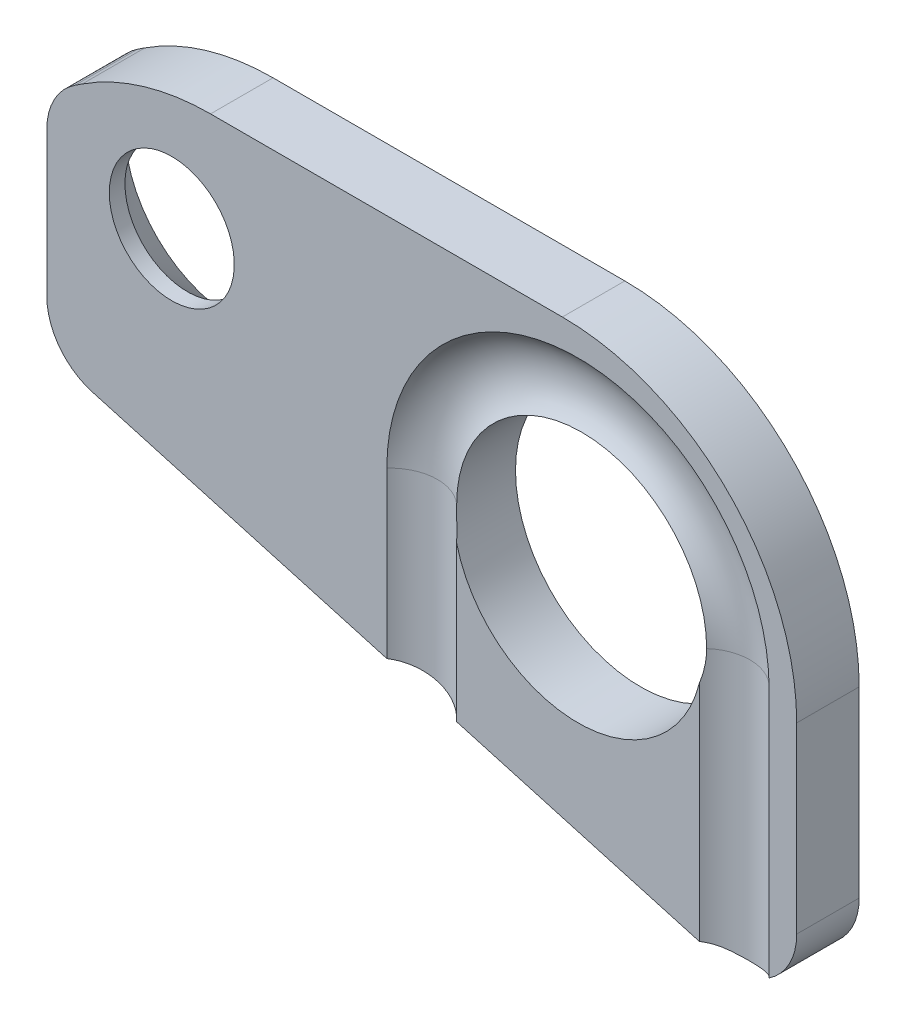
ISO-10303-21;
HEADER;
FILE_DESCRIPTION(('STEP AP214'),'2;1');
FILE_NAME('part.step','',(''),(''),'','','');
FILE_SCHEMA(('AUTOMOTIVE_DESIGN { 1 0 10303 214 1 1 1 1 }'));
ENDSEC;
DATA;
#1=APPLICATION_CONTEXT('core data for automotive mechanical design processes');
#2=APPLICATION_PROTOCOL_DEFINITION('international standard','automotive_design',2000,#1);
#3=PRODUCT_CONTEXT('',#1,'mechanical');
#4=PRODUCT('Part','Part','',(#3));
#5=PRODUCT_RELATED_PRODUCT_CATEGORY('part','',(#4));
#6=PRODUCT_DEFINITION_FORMATION('','',#4);
#7=PRODUCT_DEFINITION_CONTEXT('part definition',#1,'design');
#8=PRODUCT_DEFINITION('design','',#6,#7);
#9=PRODUCT_DEFINITION_SHAPE('','',#8);
#10=(LENGTH_UNIT() NAMED_UNIT(*) SI_UNIT(.MILLI.,.METRE.));
#11=(NAMED_UNIT(*) PLANE_ANGLE_UNIT() SI_UNIT($,.RADIAN.));
#12=(NAMED_UNIT(*) SI_UNIT($,.STERADIAN.) SOLID_ANGLE_UNIT());
#13=UNCERTAINTY_MEASURE_WITH_UNIT(LENGTH_MEASURE(1.E-05),#10,'distance_accuracy_value','');
#14=(GEOMETRIC_REPRESENTATION_CONTEXT(3) GLOBAL_UNCERTAINTY_ASSIGNED_CONTEXT((#13)) GLOBAL_UNIT_ASSIGNED_CONTEXT((#10,
#11,#12)) REPRESENTATION_CONTEXT('',''));
#15=CARTESIAN_POINT('',(0.,0.,0.));
#16=DIRECTION('',(0.,0.,1.));
#17=DIRECTION('',(1.,0.,0.));
#18=AXIS2_PLACEMENT_3D('',#15,#16,#17);
#19=CARTESIAN_POINT('',(-11.,8.95254635148678,2.));
#20=DIRECTION('',(0.,0.,-1.));
#21=DIRECTION('',(-1.,0.,0.));
#22=AXIS2_PLACEMENT_3D('',#19,#20,#21);
#23=PLANE('',#22);
#24=DIRECTION('',(0.,1.,0.));
#25=VECTOR('',#24,1.);
#26=CARTESIAN_POINT('',(7.88196601125011,-6.13485204243122,2.));
#27=LINE('',#26,#25);
#28=CARTESIAN_POINT('',(7.88196601125011,4.03545871653986,2.));
#29=VERTEX_POINT('',#28);
#30=CARTESIAN_POINT('',(7.8819660112501,-3.11474571347384,2.));
#31=VERTEX_POINT('',#30);
#32=EDGE_CURVE('E474',#29,#31,#27,.F.);
#33=ORIENTED_EDGE('',*,*,#32,.F.);
#34=CARTESIAN_POINT('',(4.,5.,2.));
#35=DIRECTION('',(0.,0.,1.));
#36=DIRECTION('',(-1.,0.,0.));
#37=AXIS2_PLACEMENT_3D('',#34,#35,#36);
#38=CIRCLE('',#37,4.);
#39=CARTESIAN_POINT('',(0.118033988749895,4.03545871653985,2.));
#40=VERTEX_POINT('',#39);
#41=EDGE_CURVE('E170',#40,#29,#38,.T.);
#42=ORIENTED_EDGE('',*,*,#41,.F.);
#43=DIRECTION('',(0.,-1.,0.));
#44=VECTOR('',#43,1.);
#45=CARTESIAN_POINT('',(0.118033988749895,5.,2.));
#46=LINE('',#45,#44);
#47=CARTESIAN_POINT('',(0.118033988749895,-0.910454763466702,2.));
#48=VERTEX_POINT('',#47);
#49=EDGE_CURVE('E62',#48,#40,#46,.F.);
#50=ORIENTED_EDGE('',*,*,#49,.F.);
#51=DIRECTION('',(0.961980017834063,-0.273119836862826,0.));
#52=VECTOR('',#51,1.);
#53=CARTESIAN_POINT('',(-11.5462396737256,2.40119876442207,2.));
#54=LINE('',#53,#52);
#55=EDGE_CURVE('E425',#48,#31,#54,.T.);
#56=ORIENTED_EDGE('',*,*,#55,.T.);
#57=EDGE_LOOP('',(#33,#42,#50,#56));
#58=FACE_BOUND('',#57,.T.);
#59=ADVANCED_FACE('F47',(#58),#23,.F.);
#60=CARTESIAN_POINT('',(-9.,8.2,2.));
#61=DIRECTION('',(0.,0.,1.));
#62=DIRECTION('',(-1.,0.,0.));
#63=AXIS2_PLACEMENT_3D('',#60,#61,#62);
#64=CIRCLE('',#63,2.);
#65=CARTESIAN_POINT('',(-11.,8.2,2.));
#66=VERTEX_POINT('',#65);
#67=EDGE_CURVE('E446',#66,#66,#64,.T.);
#68=ORIENTED_EDGE('',*,*,#67,.F.);
#69=EDGE_LOOP('',(#68));
#70=FACE_BOUND('',#69,.T.);
#71=DIRECTION('',(0.,1.,0.));
#72=VECTOR('',#71,1.);
#73=CARTESIAN_POINT('',(10.1180339887499,-6.13485204243122,2.));
#74=LINE('',#73,#72);
#75=CARTESIAN_POINT('',(10.1180339887499,-3.01143862802959,2.));
#76=VERTEX_POINT('',#75);
#77=CARTESIAN_POINT('',(10.1180339887499,5.,2.));
#78=VERTEX_POINT('',#77);
#79=EDGE_CURVE('E278',#76,#78,#74,.T.);
#80=ORIENTED_EDGE('',*,*,#79,.F.);
#81=CARTESIAN_POINT('',(9.,-1.35312623285189,2.));
#82=DIRECTION('',(0.,0.,1.));
#83=DIRECTION('',(-1.,0.,0.));
#84=AXIS2_PLACEMENT_3D('',#81,#82,#83);
#85=CIRCLE('',#84,2.);
#86=CARTESIAN_POINT('',(11.,-1.35312623285187,2.));
#87=VERTEX_POINT('',#86);
#88=EDGE_CURVE('E433',#76,#87,#85,.T.);
#89=ORIENTED_EDGE('',*,*,#88,.T.);
#90=DIRECTION('',(0.,1.,0.));
#91=VECTOR('',#90,1.);
#92=CARTESIAN_POINT('',(11.,-1.35312623285187,2.));
#93=LINE('',#92,#91);
#94=CARTESIAN_POINT('',(11.,4.49999999999995,2.));
#95=VERTEX_POINT('',#94);
#96=EDGE_CURVE('E435',#87,#95,#93,.T.);
#97=ORIENTED_EDGE('',*,*,#96,.T.);
#98=CARTESIAN_POINT('',(3.5,4.5,2.));
#99=DIRECTION('',(0.,0.,1.));
#100=DIRECTION('',(1.,0.,0.));
#101=AXIS2_PLACEMENT_3D('',#98,#99,#100);
#102=CIRCLE('',#101,7.5);
#103=CARTESIAN_POINT('',(3.49999999999995,12.,2.));
#104=VERTEX_POINT('',#103);
#105=EDGE_CURVE('E145',#95,#104,#102,.T.);
#106=ORIENTED_EDGE('',*,*,#105,.T.);
#107=DIRECTION('',(-1.,0.,0.));
#108=VECTOR('',#107,1.);
#109=CARTESIAN_POINT('',(3.49999999999995,12.,2.));
#110=LINE('',#109,#108);
#111=CARTESIAN_POINT('',(-7.7595138177386,12.,2.));
#112=VERTEX_POINT('',#111);
#113=EDGE_CURVE('E137',#104,#112,#110,.T.);
#114=ORIENTED_EDGE('',*,*,#113,.T.);
#115=CARTESIAN_POINT('',(-7.75951381773863,4.5,2.));
#116=DIRECTION('',(0.,0.,1.));
#117=DIRECTION('',(1.,0.,0.));
#118=AXIS2_PLACEMENT_3D('',#115,#116,#117);
#119=CIRCLE('',#118,7.5);
#120=CARTESIAN_POINT('',(-11.8638840401089,10.7772721048016,2.));
#121=VERTEX_POINT('',#120);
#122=EDGE_CURVE('E142',#112,#121,#119,.T.);
#123=ORIENTED_EDGE('',*,*,#122,.T.);
#124=DIRECTION('',(-0.836969613973545,-0.547249362982704,0.));
#125=VECTOR('',#124,1.);
#126=CARTESIAN_POINT('',(-11.8638840401089,10.7772721048016,2.));
#127=LINE('',#126,#125);
#128=CARTESIAN_POINT('',(-12.0944987259654,10.6264855794339,2.));
#129=VERTEX_POINT('',#128);
#130=EDGE_CURVE('E71',#121,#129,#127,.T.);
#131=ORIENTED_EDGE('',*,*,#130,.T.);
#132=CARTESIAN_POINT('',(-11.,8.95254635148678,2.));
#133=DIRECTION('',(0.,0.,1.));
#134=DIRECTION('',(-1.,0.,0.));
#135=AXIS2_PLACEMENT_3D('',#132,#133,#134);
#136=CIRCLE('',#135,2.);
#137=CARTESIAN_POINT('',(-13.,8.95254635148678,2.));
#138=VERTEX_POINT('',#137);
#139=EDGE_CURVE('E187',#129,#138,#136,.T.);
#140=ORIENTED_EDGE('',*,*,#139,.T.);
#141=DIRECTION('',(0.,-1.,0.));
#142=VECTOR('',#141,1.);
#143=CARTESIAN_POINT('',(-13.,8.95254635148678,2.));
#144=LINE('',#143,#142);
#145=CARTESIAN_POINT('',(-13.,4.32515880009021,2.));
#146=VERTEX_POINT('',#145);
#147=EDGE_CURVE('E119',#138,#146,#144,.T.);
#148=ORIENTED_EDGE('',*,*,#147,.T.);
#149=CARTESIAN_POINT('',(-11.,4.3251588000902,2.));
#150=DIRECTION('',(0.,0.,1.));
#151=DIRECTION('',(-1.,0.,0.));
#152=AXIS2_PLACEMENT_3D('',#149,#150,#151);
#153=CIRCLE('',#152,2.);
#154=CARTESIAN_POINT('',(-11.5462396737256,2.40119876442207,2.));
#155=VERTEX_POINT('',#154);
#156=EDGE_CURVE('E422',#146,#155,#153,.T.);
#157=ORIENTED_EDGE('',*,*,#156,.T.);
#158=CARTESIAN_POINT('',(-2.1180339887499,-0.275603197002795,2.));
#159=VERTEX_POINT('',#158);
#160=EDGE_CURVE('E428',#155,#159,#54,.T.);
#161=ORIENTED_EDGE('',*,*,#160,.T.);
#162=DIRECTION('',(0.,-1.,0.));
#163=VECTOR('',#162,1.);
#164=CARTESIAN_POINT('',(-2.11803398874989,5.,2.));
#165=LINE('',#164,#163);
#166=CARTESIAN_POINT('',(-2.1180339887499,5.,2.));
#167=VERTEX_POINT('',#166);
#168=EDGE_CURVE('E473',#167,#159,#165,.T.);
#169=ORIENTED_EDGE('',*,*,#168,.F.);
#170=CARTESIAN_POINT('',(4.,5.,2.));
#171=DIRECTION('',(0.,0.,-1.));
#172=DIRECTION('',(-1.,0.,0.));
#173=AXIS2_PLACEMENT_3D('',#170,#171,#172);
#174=CIRCLE('',#173,6.1180339887499);
#175=EDGE_CURVE('E466',#78,#167,#174,.F.);
#176=ORIENTED_EDGE('',*,*,#175,.F.);
#177=EDGE_LOOP('',(#80,#89,#97,#106,#114,#123,#131,#140,#148,#157,#161,#169,#176));
#178=FACE_BOUND('',#177,.T.);
#179=ADVANCED_FACE('F140',(#70,#178),#23,.F.);
#180=CARTESIAN_POINT('',(9.,-1.35312623285189,2.));
#181=DIRECTION('',(0.,0.,-1.));
#182=DIRECTION('',(-1.,0.,0.));
#183=AXIS2_PLACEMENT_3D('',#180,#181,#182);
#184=CYLINDRICAL_SURFACE('',#183,2.);
#185=CARTESIAN_POINT('',(8.45376032627433,-3.27708626852001,1.60299526885265));
#186=CARTESIAN_POINT('',(8.48522309326046,-3.28602006949857,1.59069325521865));
#187=CARTESIAN_POINT('',(8.51725960609973,-3.2942795137939,1.57939323557169));
#188=CARTESIAN_POINT('',(8.58235776485366,-3.30931962921398,1.55890951912295));
#189=CARTESIAN_POINT('',(8.61541992548174,-3.31609954367409,1.54972690507435));
#190=CARTESIAN_POINT('',(8.71585240717368,-3.33400133266125,1.52555557945458));
#191=CARTESIAN_POINT('',(8.78452521029864,-3.3427016258485,1.51392107633393));
#192=CARTESIAN_POINT('',(8.9235609202137,-3.35288491522806,1.5003149736965));
#193=CARTESIAN_POINT('',(8.9939285368118,-3.35434469972258,1.49837445110057));
#194=CARTESIAN_POINT('',(9.13392647575033,-3.34986388215696,1.50435126938794));
#195=CARTESIAN_POINT('',(9.20355754021604,-3.34393162577304,1.51225749320674));
#196=CARTESIAN_POINT('',(9.33796605577399,-3.32549588062348,1.53702114705661));
#197=CARTESIAN_POINT('',(9.40282725678758,-3.31320457616076,1.55358971584447));
#198=CARTESIAN_POINT('',(9.52865205174057,-3.28307954873457,1.59468338474754));
#199=CARTESIAN_POINT('',(9.58961171879572,-3.26524034440537,1.61921635480605));
#200=CARTESIAN_POINT('',(9.71212669864348,-3.22327484927443,1.67791203905542));
#201=CARTESIAN_POINT('',(9.77320025062785,-3.19871543955886,1.7127627653736));
#202=CARTESIAN_POINT('',(9.88880103590782,-3.14590915172949,1.78968809108542));
#203=CARTESIAN_POINT('',(9.94332951007539,-3.11766297471106,1.83176131748812));
#204=CARTESIAN_POINT('',(10.0163010847421,-3.07584821906348,1.89637495302139));
#205=CARTESIAN_POINT('',(10.0375660019688,-3.06311110615844,1.91634619863391));
#206=CARTESIAN_POINT('',(10.0787750888001,-3.0374160086054,1.95736586225701));
#207=CARTESIAN_POINT('',(10.0987221447296,-3.02445859046944,1.97841173427126));
#208=CARTESIAN_POINT('',(10.1180339887499,-3.01143862802959,2.));
#209=B_SPLINE_CURVE_WITH_KNOTS('',3,(#185,#186,#187,#188,#189,#190,#191,#192,#193,#194,#195,
#196,#197,#198,#199,#200,#201,#202,#203,#204,#205,#206,#207,#208),.UNSPECIFIED.,.F.,.F.,(4,2,2,
2,2,2,2,2,2,2,2,4),(0.,0.104783478615842,0.209620420905259,0.419107847065285,0.629266418065994,
0.839187933108115,1.04251795373459,1.24604950757646,1.46869638272158,1.69130097966603,
1.78676084731813,1.88200419230909),.UNSPECIFIED.);
#210=CARTESIAN_POINT('',(8.45376032627433,-3.27708626852001,1.60299526885265));
#211=VERTEX_POINT('',#210);
#212=EDGE_CURVE('E271',#211,#76,#209,.T.);
#213=ORIENTED_EDGE('',*,*,#212,.F.);
#214=DIRECTION('',(0.,0.,-1.));
#215=VECTOR('',#214,1.);
#216=CARTESIAN_POINT('',(8.45376032627433,-3.27708626852001,2.));
#217=LINE('',#216,#215);
#218=CARTESIAN_POINT('',(8.45376032627433,-3.27708626852001,0.));
#219=VERTEX_POINT('',#218);
#220=EDGE_CURVE('E197',#211,#219,#217,.T.);
#221=ORIENTED_EDGE('',*,*,#220,.T.);
#222=CARTESIAN_POINT('',(9.,-1.35312623285189,0.));
#223=DIRECTION('',(0.,0.,1.));
#224=DIRECTION('',(-1.,0.,0.));
#225=AXIS2_PLACEMENT_3D('',#222,#223,#224);
#226=CIRCLE('',#225,2.);
#227=CARTESIAN_POINT('',(11.,-1.35312623285187,0.));
#228=VERTEX_POINT('',#227);
#229=EDGE_CURVE('E177',#219,#228,#226,.T.);
#230=ORIENTED_EDGE('',*,*,#229,.T.);
#231=DIRECTION('',(0.,0.,-1.));
#232=VECTOR('',#231,1.);
#233=CARTESIAN_POINT('',(11.,-1.35312623285187,2.));
#234=LINE('',#233,#232);
#235=EDGE_CURVE('E194',#87,#228,#234,.T.);
#236=ORIENTED_EDGE('',*,*,#235,.F.);
#237=ORIENTED_EDGE('',*,*,#88,.F.);
#238=EDGE_LOOP('',(#213,#221,#230,#236,#237));
#239=FACE_BOUND('',#238,.T.);
#240=ADVANCED_FACE('F243',(#239),#184,.T.);
#241=CARTESIAN_POINT('',(4.,5.,2.));
#242=DIRECTION('',(0.,0.,-1.));
#243=DIRECTION('',(-1.,0.,0.));
#244=AXIS2_PLACEMENT_3D('',#241,#242,#243);
#245=CYLINDRICAL_SURFACE('',#244,4.);
#246=CARTESIAN_POINT('',(4.,5.,0.));
#247=DIRECTION('',(0.,0.,1.));
#248=DIRECTION('',(-1.,0.,0.));
#249=AXIS2_PLACEMENT_3D('',#246,#247,#248);
#250=CIRCLE('',#249,4.);
#251=CARTESIAN_POINT('',(0.,5.,0.));
#252=VERTEX_POINT('',#251);
#253=EDGE_CURVE('E443',#252,#252,#250,.T.);
#254=ORIENTED_EDGE('',*,*,#253,.F.);
#255=EDGE_LOOP('',(#254));
#256=FACE_BOUND('',#255,.T.);
#257=ORIENTED_EDGE('',*,*,#41,.T.);
#258=CARTESIAN_POINT('',(7.88196601125011,4.03545871653986,2.));
#259=CARTESIAN_POINT('',(7.89683000367049,4.09523481356459,1.98342398659821));
#260=CARTESIAN_POINT('',(7.91041946468569,4.15587272009715,1.96893202296529));
#261=CARTESIAN_POINT('',(7.93487403053109,4.27844212948327,1.94366771261361));
#262=CARTESIAN_POINT('',(7.94574001335882,4.34037320844973,1.93289416672439));
#263=CARTESIAN_POINT('',(7.96447483003007,4.46442745556306,1.9147122418162));
#264=CARTESIAN_POINT('',(7.97237639479184,4.52654039958246,1.90726692775157));
#265=CARTESIAN_POINT('',(7.98526847636052,4.65133545782075,1.89528329379255));
#266=CARTESIAN_POINT('',(7.99025956179831,4.71401745842902,1.89074440604211));
#267=CARTESIAN_POINT('',(7.99584125474153,4.81390416625009,1.88569652582128));
#268=CARTESIAN_POINT('',(7.99739708494606,4.85101533962385,1.88429823508406));
#269=CARTESIAN_POINT('',(7.99947839282466,4.92541674747981,1.88243238101856));
#270=CARTESIAN_POINT('',(8.0000003385797,4.9627071610048,1.88196800802427));
#271=CARTESIAN_POINT('',(8.,5.,1.88196601125011));
#272=B_SPLINE_CURVE_WITH_KNOTS('',3,(#258,#259,#260,#261,#262,#263,#264,#265,#266,#267,#268,
#269,#270,#271),.UNSPECIFIED.,.F.,.F.,(4,2,2,2,2,2,4),(0.,0.191266772856852,0.382471805408383,
0.571498799983244,0.760488851286407,0.871975634702898,0.983842622917628),.UNSPECIFIED.);
#273=CARTESIAN_POINT('',(8.,5.,1.88196601125011));
#274=VERTEX_POINT('',#273);
#275=EDGE_CURVE('E284',#29,#274,#272,.T.);
#276=ORIENTED_EDGE('',*,*,#275,.T.);
#277=CARTESIAN_POINT('',(4.,5.,1.88196601125011));
#278=DIRECTION('',(0.,0.,1.));
#279=DIRECTION('',(1.,0.,0.));
#280=AXIS2_PLACEMENT_3D('',#277,#278,#279);
#281=CIRCLE('',#280,4.);
#282=CARTESIAN_POINT('',(0.,5.,1.88196601125011));
#283=VERTEX_POINT('',#282);
#284=EDGE_CURVE('E214',#274,#283,#281,.T.);
#285=ORIENTED_EDGE('',*,*,#284,.T.);
#286=CARTESIAN_POINT('',(0.,5.,1.88196601125011));
#287=CARTESIAN_POINT('',(-4.38086623795825E-07,4.95884462813062,1.88196874844918));
#288=CARTESIAN_POINT('',(0.000635286188607783,4.91769338522283,1.88253383323086));
#289=CARTESIAN_POINT('',(0.00317392897887362,4.83546064551654,1.88481110389118));
#290=CARTESIAN_POINT('',(0.00507688552456335,4.79437915084834,1.88652332419628));
#291=CARTESIAN_POINT('',(0.0126385224392315,4.6719879675915,1.89337769394507));
#292=CARTESIAN_POINT('',(0.0201502868573378,4.59087460820093,1.90023703121141));
#293=CARTESIAN_POINT('',(0.0400184087380348,4.42979967667277,1.91900508531431));
#294=CARTESIAN_POINT('',(0.0523757887870486,4.34983835134789,1.93091486800645));
#295=CARTESIAN_POINT('',(0.0743957490193251,4.23105761515482,1.95320389751663));
#296=CARTESIAN_POINT('',(0.0823547316062631,4.19150399978317,1.9614121799934));
#297=CARTESIAN_POINT('',(0.0993789151244316,4.11299865988592,1.97945249325174));
#298=CARTESIAN_POINT('',(0.108444426604257,4.07404710780162,1.98928498014297));
#299=CARTESIAN_POINT('',(0.118033988749895,4.03545871653985,2.));
#300=B_SPLINE_CURVE_WITH_KNOTS('',3,(#286,#287,#288,#289,#290,#291,#292,#293,#294,#295,#296,
#297,#298,#299),.UNSPECIFIED.,.F.,.F.,(4,2,2,2,2,2,4),(0.,0.123448856740869,0.246901418447781,
0.491841840838475,0.736833981666203,0.86030732785158,0.983815406995786),.UNSPECIFIED.);
#301=EDGE_CURVE('E207',#283,#40,#300,.T.);
#302=ORIENTED_EDGE('',*,*,#301,.T.);
#303=EDGE_LOOP('',(#257,#276,#285,#302));
#304=FACE_BOUND('',#303,.T.);
#305=ADVANCED_FACE('F216',(#256,#304),#245,.F.);
#306=CARTESIAN_POINT('',(-11.,8.95254635148678,0.));
#307=DIRECTION('',(0.,0.,-1.));
#308=DIRECTION('',(-1.,0.,0.));
#309=AXIS2_PLACEMENT_3D('',#306,#307,#308);
#310=PLANE('',#309);
#311=CARTESIAN_POINT('',(-9.,8.2,0.));
#312=DIRECTION('',(0.,0.,-1.));
#313=DIRECTION('',(-1.,0.,0.));
#314=AXIS2_PLACEMENT_3D('',#311,#312,#313);
#315=CIRCLE('',#314,3.5);
#316=CARTESIAN_POINT('',(-12.5,8.2,0.));
#317=VERTEX_POINT('',#316);
#318=EDGE_CURVE('E55',#317,#317,#315,.F.);
#319=ORIENTED_EDGE('',*,*,#318,.T.);
#320=EDGE_LOOP('',(#319));
#321=FACE_BOUND('',#320,.T.);
#322=ORIENTED_EDGE('',*,*,#253,.T.);
#323=EDGE_LOOP('',(#322));
#324=FACE_BOUND('',#323,.T.);
#325=CARTESIAN_POINT('',(-11.,8.95254635148678,0.));
#326=DIRECTION('',(0.,0.,1.));
#327=DIRECTION('',(-1.,0.,0.));
#328=AXIS2_PLACEMENT_3D('',#325,#326,#327);
#329=CIRCLE('',#328,2.);
#330=CARTESIAN_POINT('',(-12.0944987259654,10.6264855794339,0.));
#331=VERTEX_POINT('',#330);
#332=CARTESIAN_POINT('',(-13.,8.95254635148678,0.));
#333=VERTEX_POINT('',#332);
#334=EDGE_CURVE('E166',#331,#333,#329,.T.);
#335=ORIENTED_EDGE('',*,*,#334,.F.);
#336=DIRECTION('',(-0.836969613973545,-0.547249362982704,0.));
#337=VECTOR('',#336,1.);
#338=CARTESIAN_POINT('',(-11.8638840401089,10.7772721048016,0.));
#339=LINE('',#338,#337);
#340=CARTESIAN_POINT('',(-11.8638840401089,10.7772721048016,0.));
#341=VERTEX_POINT('',#340);
#342=EDGE_CURVE('E110',#341,#331,#339,.T.);
#343=ORIENTED_EDGE('',*,*,#342,.F.);
#344=CARTESIAN_POINT('',(-7.75951381773863,4.5,0.));
#345=DIRECTION('',(0.,0.,1.));
#346=DIRECTION('',(1.,0.,0.));
#347=AXIS2_PLACEMENT_3D('',#344,#345,#346);
#348=CIRCLE('',#347,7.5);
#349=CARTESIAN_POINT('',(-7.7595138177386,12.,0.));
#350=VERTEX_POINT('',#349);
#351=EDGE_CURVE('E184',#350,#341,#348,.T.);
#352=ORIENTED_EDGE('',*,*,#351,.F.);
#353=DIRECTION('',(-1.,0.,0.));
#354=VECTOR('',#353,1.);
#355=CARTESIAN_POINT('',(3.49999999999995,12.,0.));
#356=LINE('',#355,#354);
#357=CARTESIAN_POINT('',(3.49999999999995,12.,0.));
#358=VERTEX_POINT('',#357);
#359=EDGE_CURVE('E154',#358,#350,#356,.T.);
#360=ORIENTED_EDGE('',*,*,#359,.F.);
#361=CARTESIAN_POINT('',(3.5,4.5,0.));
#362=DIRECTION('',(0.,0.,1.));
#363=DIRECTION('',(1.,0.,0.));
#364=AXIS2_PLACEMENT_3D('',#361,#362,#363);
#365=CIRCLE('',#364,7.5);
#366=CARTESIAN_POINT('',(11.,4.49999999999995,0.));
#367=VERTEX_POINT('',#366);
#368=EDGE_CURVE('E181',#367,#358,#365,.T.);
#369=ORIENTED_EDGE('',*,*,#368,.F.);
#370=DIRECTION('',(0.,1.,0.));
#371=VECTOR('',#370,1.);
#372=CARTESIAN_POINT('',(11.,-1.35312623285187,0.));
#373=LINE('',#372,#371);
#374=EDGE_CURVE('E179',#228,#367,#373,.T.);
#375=ORIENTED_EDGE('',*,*,#374,.F.);
#376=ORIENTED_EDGE('',*,*,#229,.F.);
#377=DIRECTION('',(0.961980017834063,-0.273119836862826,0.));
#378=VECTOR('',#377,1.);
#379=CARTESIAN_POINT('',(-11.5462396737256,2.40119876442207,0.));
#380=LINE('',#379,#378);
#381=CARTESIAN_POINT('',(-11.5462396737256,2.40119876442207,0.));
#382=VERTEX_POINT('',#381);
#383=EDGE_CURVE('E174',#382,#219,#380,.T.);
#384=ORIENTED_EDGE('',*,*,#383,.F.);
#385=CARTESIAN_POINT('',(-11.,4.3251588000902,0.));
#386=DIRECTION('',(0.,0.,1.));
#387=DIRECTION('',(-1.,0.,0.));
#388=AXIS2_PLACEMENT_3D('',#385,#386,#387);
#389=CIRCLE('',#388,2.);
#390=CARTESIAN_POINT('',(-13.,4.32515880009021,0.));
#391=VERTEX_POINT('',#390);
#392=EDGE_CURVE('E172',#391,#382,#389,.T.);
#393=ORIENTED_EDGE('',*,*,#392,.F.);
#394=DIRECTION('',(0.,-1.,0.));
#395=VECTOR('',#394,1.);
#396=CARTESIAN_POINT('',(-13.,8.95254635148678,0.));
#397=LINE('',#396,#395);
#398=EDGE_CURVE('E169',#333,#391,#397,.T.);
#399=ORIENTED_EDGE('',*,*,#398,.F.);
#400=EDGE_LOOP('',(#335,#343,#352,#360,#369,#375,#376,#384,#393,#399));
#401=FACE_BOUND('',#400,.T.);
#402=ADVANCED_FACE('F247',(#321,#324,#401),#310,.T.);
#403=CARTESIAN_POINT('',(-11.,8.95254635148678,2.));
#404=DIRECTION('',(0.,0.,-1.));
#405=DIRECTION('',(-1.,0.,0.));
#406=AXIS2_PLACEMENT_3D('',#403,#404,#405);
#407=CYLINDRICAL_SURFACE('',#406,2.);
#408=ORIENTED_EDGE('',*,*,#334,.T.);
#409=DIRECTION('',(0.,0.,-1.));
#410=VECTOR('',#409,1.);
#411=CARTESIAN_POINT('',(-13.,8.95254635148678,2.));
#412=LINE('',#411,#410);
#413=EDGE_CURVE('E205',#138,#333,#412,.T.);
#414=ORIENTED_EDGE('',*,*,#413,.F.);
#415=ORIENTED_EDGE('',*,*,#139,.F.);
#416=DIRECTION('',(0.,0.,-1.));
#417=VECTOR('',#416,1.);
#418=CARTESIAN_POINT('',(-12.0944987259654,10.6264855794339,2.));
#419=LINE('',#418,#417);
#420=EDGE_CURVE('E162',#129,#331,#419,.T.);
#421=ORIENTED_EDGE('',*,*,#420,.T.);
#422=EDGE_LOOP('',(#408,#414,#415,#421));
#423=FACE_BOUND('',#422,.T.);
#424=ADVANCED_FACE('F249',(#423),#407,.T.);
#425=CARTESIAN_POINT('',(-13.,8.95254635148678,2.));
#426=DIRECTION('',(1.,0.,0.));
#427=DIRECTION('',(0.,1.,0.));
#428=AXIS2_PLACEMENT_3D('',#425,#426,#427);
#429=PLANE('',#428);
#430=ORIENTED_EDGE('',*,*,#398,.T.);
#431=DIRECTION('',(0.,0.,-1.));
#432=VECTOR('',#431,1.);
#433=CARTESIAN_POINT('',(-13.,4.32515880009021,2.));
#434=LINE('',#433,#432);
#435=EDGE_CURVE('E202',#146,#391,#434,.T.);
#436=ORIENTED_EDGE('',*,*,#435,.F.);
#437=ORIENTED_EDGE('',*,*,#147,.F.);
#438=ORIENTED_EDGE('',*,*,#413,.T.);
#439=EDGE_LOOP('',(#430,#436,#437,#438));
#440=FACE_BOUND('',#439,.T.);
#441=ADVANCED_FACE('F386',(#440),#429,.F.);
#442=CARTESIAN_POINT('',(-11.,4.3251588000902,2.));
#443=DIRECTION('',(0.,0.,-1.));
#444=DIRECTION('',(-1.,0.,0.));
#445=AXIS2_PLACEMENT_3D('',#442,#443,#444);
#446=CYLINDRICAL_SURFACE('',#445,2.);
#447=ORIENTED_EDGE('',*,*,#392,.T.);
#448=DIRECTION('',(0.,0.,-1.));
#449=VECTOR('',#448,1.);
#450=CARTESIAN_POINT('',(-11.5462396737256,2.40119876442207,2.));
#451=LINE('',#450,#449);
#452=EDGE_CURVE('E199',#155,#382,#451,.T.);
#453=ORIENTED_EDGE('',*,*,#452,.F.);
#454=ORIENTED_EDGE('',*,*,#156,.F.);
#455=ORIENTED_EDGE('',*,*,#435,.T.);
#456=EDGE_LOOP('',(#447,#453,#454,#455));
#457=FACE_BOUND('',#456,.T.);
#458=ADVANCED_FACE('F323',(#457),#446,.T.);
#459=CARTESIAN_POINT('',(-11.5462396737256,2.40119876442207,2.));
#460=DIRECTION('',(0.273119836862826,0.961980017834063,0.));
#461=DIRECTION('',(-0.961980017834063,0.273119836862826,0.));
#462=AXIS2_PLACEMENT_3D('',#459,#460,#461);
#463=PLANE('',#462);
#464=CARTESIAN_POINT('',(9.,-3.43217149670579,3.));
#465=DIRECTION('',(0.273119836862826,0.961980017834063,0.));
#466=DIRECTION('',(-0.961980017834063,0.273119836862826,0.));
#467=AXIS2_PLACEMENT_3D('',#464,#465,#466);
#468=ELLIPSE('',#467,1.55928394789043,1.5);
#469=EDGE_CURVE('E279',#31,#211,#468,.F.);
#470=ORIENTED_EDGE('',*,*,#469,.F.);
#471=ORIENTED_EDGE('',*,*,#55,.F.);
#472=CARTESIAN_POINT('',(-1.,-0.593028980234748,3.));
#473=DIRECTION('',(0.273119836862826,0.961980017834063,0.));
#474=DIRECTION('',(0.961980017834063,-0.273119836862826,0.));
#475=AXIS2_PLACEMENT_3D('',#472,#473,#474);
#476=ELLIPSE('',#475,1.55928394789043,1.5);
#477=EDGE_CURVE('E477',#159,#48,#476,.F.);
#478=ORIENTED_EDGE('',*,*,#477,.F.);
#479=ORIENTED_EDGE('',*,*,#160,.F.);
#480=ORIENTED_EDGE('',*,*,#452,.T.);
#481=ORIENTED_EDGE('',*,*,#383,.T.);
#482=ORIENTED_EDGE('',*,*,#220,.F.);
#483=EDGE_LOOP('',(#470,#471,#478,#479,#480,#481,#482));
#484=FACE_BOUND('',#483,.T.);
#485=ADVANCED_FACE('F263',(#484),#463,.F.);
#486=CARTESIAN_POINT('',(11.,-1.35312623285187,2.));
#487=DIRECTION('',(-1.,0.,0.));
#488=DIRECTION('',(0.,0.,1.));
#489=AXIS2_PLACEMENT_3D('',#486,#487,#488);
#490=PLANE('',#489);
#491=ORIENTED_EDGE('',*,*,#374,.T.);
#492=DIRECTION('',(0.,0.,-1.));
#493=VECTOR('',#492,1.);
#494=CARTESIAN_POINT('',(11.,4.49999999999995,2.));
#495=LINE('',#494,#493);
#496=EDGE_CURVE('E191',#95,#367,#495,.T.);
#497=ORIENTED_EDGE('',*,*,#496,.F.);
#498=ORIENTED_EDGE('',*,*,#96,.F.);
#499=ORIENTED_EDGE('',*,*,#235,.T.);
#500=EDGE_LOOP('',(#491,#497,#498,#499));
#501=FACE_BOUND('',#500,.T.);
#502=ADVANCED_FACE('F259',(#501),#490,.F.);
#503=CARTESIAN_POINT('',(3.5,4.5,2.));
#504=DIRECTION('',(0.,0.,-1.));
#505=DIRECTION('',(-1.,0.,0.));
#506=AXIS2_PLACEMENT_3D('',#503,#504,#505);
#507=CYLINDRICAL_SURFACE('',#506,7.5);
#508=ORIENTED_EDGE('',*,*,#368,.T.);
#509=DIRECTION('',(0.,0.,-1.));
#510=VECTOR('',#509,1.);
#511=CARTESIAN_POINT('',(3.49999999999995,12.,2.));
#512=LINE('',#511,#510);
#513=EDGE_CURVE('E157',#104,#358,#512,.T.);
#514=ORIENTED_EDGE('',*,*,#513,.F.);
#515=ORIENTED_EDGE('',*,*,#105,.F.);
#516=ORIENTED_EDGE('',*,*,#496,.T.);
#517=EDGE_LOOP('',(#508,#514,#515,#516));
#518=FACE_BOUND('',#517,.T.);
#519=ADVANCED_FACE('F256',(#518),#507,.T.);
#520=CARTESIAN_POINT('',(3.49999999999995,12.,2.));
#521=DIRECTION('',(0.,-1.,0.));
#522=DIRECTION('',(0.,0.,-1.));
#523=AXIS2_PLACEMENT_3D('',#520,#521,#522);
#524=PLANE('',#523);
#525=ORIENTED_EDGE('',*,*,#359,.T.);
#526=DIRECTION('',(0.,0.,-1.));
#527=VECTOR('',#526,1.);
#528=CARTESIAN_POINT('',(-7.7595138177386,12.,2.));
#529=LINE('',#528,#527);
#530=EDGE_CURVE('E151',#112,#350,#529,.T.);
#531=ORIENTED_EDGE('',*,*,#530,.F.);
#532=ORIENTED_EDGE('',*,*,#113,.F.);
#533=ORIENTED_EDGE('',*,*,#513,.T.);
#534=EDGE_LOOP('',(#525,#531,#532,#533));
#535=FACE_BOUND('',#534,.T.);
#536=ADVANCED_FACE('F152',(#535),#524,.F.);
#537=CARTESIAN_POINT('',(-7.75951381773863,4.5,2.));
#538=DIRECTION('',(0.,0.,-1.));
#539=DIRECTION('',(-1.,0.,0.));
#540=AXIS2_PLACEMENT_3D('',#537,#538,#539);
#541=CYLINDRICAL_SURFACE('',#540,7.5);
#542=ORIENTED_EDGE('',*,*,#351,.T.);
#543=DIRECTION('',(0.,0.,-1.));
#544=VECTOR('',#543,1.);
#545=CARTESIAN_POINT('',(-11.8638840401089,10.7772721048016,2.));
#546=LINE('',#545,#544);
#547=EDGE_CURVE('E158',#121,#341,#546,.T.);
#548=ORIENTED_EDGE('',*,*,#547,.F.);
#549=ORIENTED_EDGE('',*,*,#122,.F.);
#550=ORIENTED_EDGE('',*,*,#530,.T.);
#551=EDGE_LOOP('',(#542,#548,#549,#550));
#552=FACE_BOUND('',#551,.T.);
#553=ADVANCED_FACE('F160',(#552),#541,.T.);
#554=CARTESIAN_POINT('',(-11.8638840401089,10.7772721048016,2.));
#555=DIRECTION('',(0.547249362982704,-0.836969613973545,0.));
#556=DIRECTION('',(0.836969613973545,0.547249362982704,0.));
#557=AXIS2_PLACEMENT_3D('',#554,#555,#556);
#558=PLANE('',#557);
#559=ORIENTED_EDGE('',*,*,#342,.T.);
#560=ORIENTED_EDGE('',*,*,#420,.F.);
#561=ORIENTED_EDGE('',*,*,#130,.F.);
#562=ORIENTED_EDGE('',*,*,#547,.T.);
#563=EDGE_LOOP('',(#559,#560,#561,#562));
#564=FACE_BOUND('',#563,.T.);
#565=ADVANCED_FACE('F229',(#564),#558,.F.);
#566=CARTESIAN_POINT('',(-9.,8.2,2.));
#567=DIRECTION('',(0.,0.,-1.));
#568=DIRECTION('',(-1.,0.,0.));
#569=AXIS2_PLACEMENT_3D('',#566,#567,#568);
#570=CYLINDRICAL_SURFACE('',#569,2.);
#571=CARTESIAN_POINT('',(-9.,8.2,1.5));
#572=DIRECTION('',(0.,0.,-1.));
#573=DIRECTION('',(-1.,0.,0.));
#574=AXIS2_PLACEMENT_3D('',#571,#572,#573);
#575=CIRCLE('',#574,2.);
#576=CARTESIAN_POINT('',(-11.,8.2,1.5));
#577=VERTEX_POINT('',#576);
#578=EDGE_CURVE('E12',#577,#577,#575,.T.);
#579=ORIENTED_EDGE('',*,*,#578,.T.);
#580=EDGE_LOOP('',(#579));
#581=FACE_BOUND('',#580,.T.);
#582=ORIENTED_EDGE('',*,*,#67,.T.);
#583=EDGE_LOOP('',(#582));
#584=FACE_BOUND('',#583,.T.);
#585=ADVANCED_FACE('F226',(#581,#584),#570,.F.);
#586=CARTESIAN_POINT('',(9.,-6.13485204243122,3.));
#587=DIRECTION('',(0.,1.,0.));
#588=DIRECTION('',(-1.,0.,0.));
#589=AXIS2_PLACEMENT_3D('',#586,#587,#588);
#590=CYLINDRICAL_SURFACE('',#589,1.5);
#591=ORIENTED_EDGE('',*,*,#79,.T.);
#592=CARTESIAN_POINT('',(9.,5.,3.));
#593=DIRECTION('',(0.,-1.,0.));
#594=DIRECTION('',(0.,0.,1.));
#595=AXIS2_PLACEMENT_3D('',#592,#593,#594);
#596=CIRCLE('',#595,1.5);
#597=EDGE_CURVE('E456',#274,#78,#596,.T.);
#598=ORIENTED_EDGE('',*,*,#597,.F.);
#599=ORIENTED_EDGE('',*,*,#275,.F.);
#600=ORIENTED_EDGE('',*,*,#32,.T.);
#601=ORIENTED_EDGE('',*,*,#469,.T.);
#602=ORIENTED_EDGE('',*,*,#212,.T.);
#603=EDGE_LOOP('',(#591,#598,#599,#600,#601,#602));
#604=FACE_BOUND('',#603,.T.);
#605=ADVANCED_FACE('F228',(#604),#590,.F.);
#606=CARTESIAN_POINT('',(4.,5.,3.));
#607=DIRECTION('',(0.,0.,1.));
#608=DIRECTION('',(1.,0.,0.));
#609=AXIS2_PLACEMENT_3D('',#606,#607,#608);
#610=TOROIDAL_SURFACE('',#609,5.,1.5);
#611=ORIENTED_EDGE('',*,*,#175,.T.);
#612=CARTESIAN_POINT('',(-1.,5.,3.));
#613=DIRECTION('',(0.,1.,0.));
#614=DIRECTION('',(0.,0.,1.));
#615=AXIS2_PLACEMENT_3D('',#612,#613,#614);
#616=CIRCLE('',#615,1.5);
#617=EDGE_CURVE('E469',#283,#167,#616,.T.);
#618=ORIENTED_EDGE('',*,*,#617,.F.);
#619=ORIENTED_EDGE('',*,*,#284,.F.);
#620=ORIENTED_EDGE('',*,*,#597,.T.);
#621=EDGE_LOOP('',(#611,#618,#619,#620));
#622=FACE_BOUND('',#621,.T.);
#623=ADVANCED_FACE('F224',(#622),#610,.F.);
#624=CARTESIAN_POINT('',(-1.,5.,3.));
#625=DIRECTION('',(0.,-1.,0.));
#626=DIRECTION('',(0.,0.,-1.));
#627=AXIS2_PLACEMENT_3D('',#624,#625,#626);
#628=CYLINDRICAL_SURFACE('',#627,1.5);
#629=ORIENTED_EDGE('',*,*,#168,.T.);
#630=ORIENTED_EDGE('',*,*,#477,.T.);
#631=ORIENTED_EDGE('',*,*,#49,.T.);
#632=ORIENTED_EDGE('',*,*,#301,.F.);
#633=ORIENTED_EDGE('',*,*,#617,.T.);
#634=EDGE_LOOP('',(#629,#630,#631,#632,#633));
#635=FACE_BOUND('',#634,.T.);
#636=ADVANCED_FACE('F220',(#635),#628,.F.);
#637=CARTESIAN_POINT('',(-9.,8.2,0.));
#638=DIRECTION('',(0.,0.,-1.));
#639=DIRECTION('',(-1.,0.,0.));
#640=AXIS2_PLACEMENT_3D('',#637,#638,#639);
#641=CONICAL_SURFACE('',#640,3.5,0.785398163397447);
#642=ORIENTED_EDGE('',*,*,#578,.F.);
#643=EDGE_LOOP('',(#642));
#644=FACE_BOUND('',#643,.T.);
#645=ORIENTED_EDGE('',*,*,#318,.F.);
#646=EDGE_LOOP('',(#645));
#647=FACE_BOUND('',#646,.T.);
#648=ADVANCED_FACE('F49',(#644,#647),#641,.F.);
#649=CLOSED_SHELL('',(#59,#179,#240,#305,#402,#424,#441,#458,#485,#502,#519,#536,#553,#565,#585,
#605,#623,#636,#648));
#650=MANIFOLD_SOLID_BREP('B2',#649);
#651=ADVANCED_BREP_SHAPE_REPRESENTATION('',(#18,#650),#14);
#652=SHAPE_DEFINITION_REPRESENTATION(#9,#651);
ENDSEC;
END-ISO-10303-21;
